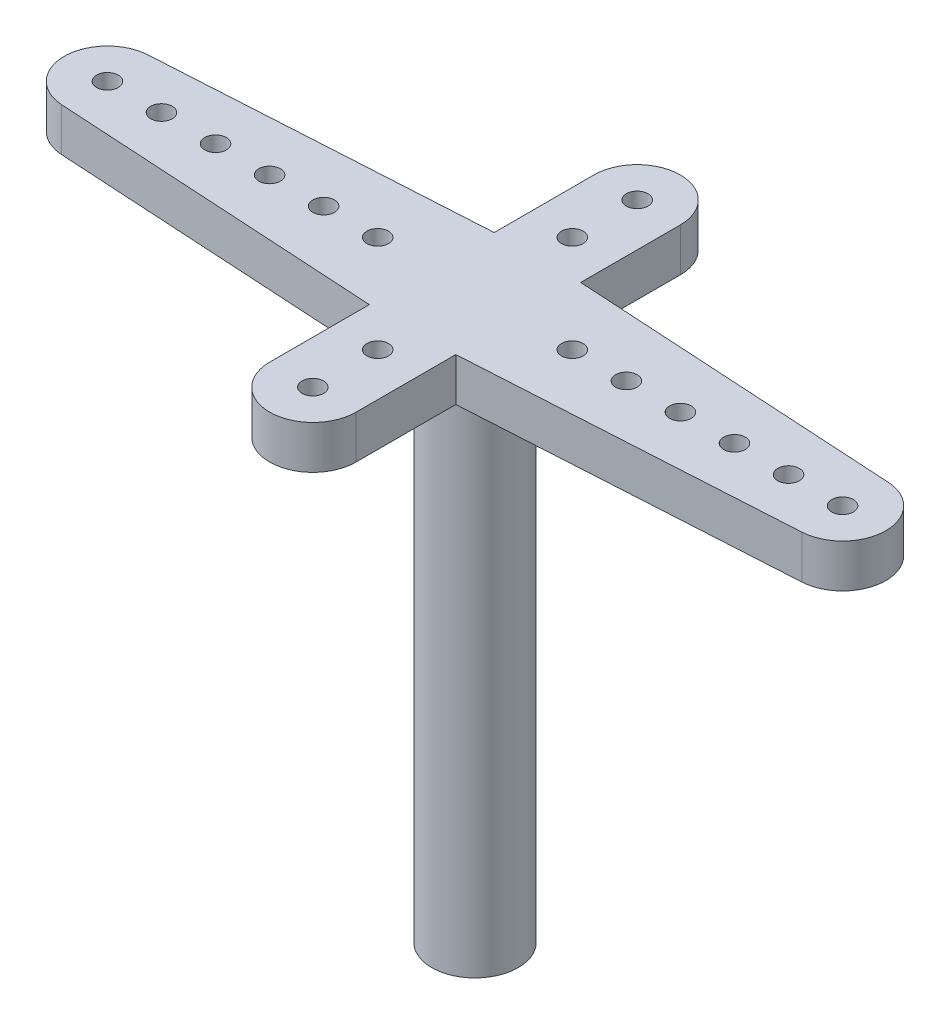
ISO-10303-21;
HEADER;
FILE_DESCRIPTION(('STEP AP214'),'2;1');
FILE_NAME('part.step','',(''),(''),'','','');
FILE_SCHEMA(('AUTOMOTIVE_DESIGN { 1 0 10303 214 1 1 1 1 }'));
ENDSEC;
DATA;
#1=APPLICATION_CONTEXT('core data for automotive mechanical design processes');
#2=APPLICATION_PROTOCOL_DEFINITION('international standard','automotive_design',2000,#1);
#3=PRODUCT_CONTEXT('',#1,'mechanical');
#4=PRODUCT('Part','Part','',(#3));
#5=PRODUCT_RELATED_PRODUCT_CATEGORY('part','',(#4));
#6=PRODUCT_DEFINITION_FORMATION('','',#4);
#7=PRODUCT_DEFINITION_CONTEXT('part definition',#1,'design');
#8=PRODUCT_DEFINITION('design','',#6,#7);
#9=PRODUCT_DEFINITION_SHAPE('','',#8);
#10=(LENGTH_UNIT() NAMED_UNIT(*) SI_UNIT(.MILLI.,.METRE.));
#11=(NAMED_UNIT(*) PLANE_ANGLE_UNIT() SI_UNIT($,.RADIAN.));
#12=(NAMED_UNIT(*) SI_UNIT($,.STERADIAN.) SOLID_ANGLE_UNIT());
#13=UNCERTAINTY_MEASURE_WITH_UNIT(LENGTH_MEASURE(1.E-05),#10,'distance_accuracy_value','');
#14=(GEOMETRIC_REPRESENTATION_CONTEXT(3) GLOBAL_UNCERTAINTY_ASSIGNED_CONTEXT((#13)) GLOBAL_UNIT_ASSIGNED_CONTEXT((#10,
#11,#12)) REPRESENTATION_CONTEXT('',''));
#15=CARTESIAN_POINT('',(0.,0.,0.));
#16=DIRECTION('',(0.,0.,1.));
#17=DIRECTION('',(1.,0.,0.));
#18=AXIS2_PLACEMENT_3D('',#15,#16,#17);
#19=CARTESIAN_POINT('',(17.,2.,0.));
#20=DIRECTION('',(0.,-1.,0.));
#21=DIRECTION('',(0.,0.,-1.));
#22=AXIS2_PLACEMENT_3D('',#19,#20,#21);
#23=PLANE('',#22);
#24=CARTESIAN_POINT('',(17.,2.,0.));
#25=DIRECTION('',(0.,1.,0.));
#26=DIRECTION('',(0.,0.,-1.));
#27=AXIS2_PLACEMENT_3D('',#24,#25,#26);
#28=CIRCLE('',#27,2.);
#29=CARTESIAN_POINT('',(17.1176470588235,2.,1.99653679393849));
#30=VERTEX_POINT('',#29);
#31=CARTESIAN_POINT('',(17.1176470588235,2.,-1.99653679393849));
#32=VERTEX_POINT('',#31);
#33=EDGE_CURVE('E182',#30,#32,#28,.T.);
#34=ORIENTED_EDGE('',*,*,#33,.T.);
#35=DIRECTION('',(-0.998268396969243,0.,-0.0588235294117646));
#36=VECTOR('',#35,1.);
#37=CARTESIAN_POINT('',(17.1176470588235,2.,-1.99653679393849));
#38=LINE('',#37,#36);
#39=CARTESIAN_POINT('',(2.,2.,-2.88735268984507));
#40=VERTEX_POINT('',#39);
#41=EDGE_CURVE('E110',#32,#40,#38,.T.);
#42=ORIENTED_EDGE('',*,*,#41,.T.);
#43=DIRECTION('',(0.,0.,-1.));
#44=VECTOR('',#43,1.);
#45=CARTESIAN_POINT('',(2.,2.,-7.5));
#46=LINE('',#45,#44);
#47=CARTESIAN_POINT('',(2.,2.,-7.5));
#48=VERTEX_POINT('',#47);
#49=EDGE_CURVE('E209',#40,#48,#46,.T.);
#50=ORIENTED_EDGE('',*,*,#49,.T.);
#51=CARTESIAN_POINT('',(0.,2.,-7.5));
#52=DIRECTION('',(0.,1.,0.));
#53=DIRECTION('',(0.,0.,-1.));
#54=AXIS2_PLACEMENT_3D('',#51,#52,#53);
#55=CIRCLE('',#54,2.);
#56=CARTESIAN_POINT('',(-2.,2.,-7.5));
#57=VERTEX_POINT('',#56);
#58=EDGE_CURVE('E228',#48,#57,#55,.T.);
#59=ORIENTED_EDGE('',*,*,#58,.T.);
#60=DIRECTION('',(0.,0.,1.));
#61=VECTOR('',#60,1.);
#62=CARTESIAN_POINT('',(-2.,2.,-7.5));
#63=LINE('',#62,#61);
#64=CARTESIAN_POINT('',(-2.,2.,-2.88735268984507));
#65=VERTEX_POINT('',#64);
#66=EDGE_CURVE('E225',#57,#65,#63,.T.);
#67=ORIENTED_EDGE('',*,*,#66,.T.);
#68=DIRECTION('',(-0.998268396969243,0.,0.0588235294117646));
#69=VECTOR('',#68,1.);
#70=CARTESIAN_POINT('',(-17.1176470588235,2.,-1.99653679393849));
#71=LINE('',#70,#69);
#72=CARTESIAN_POINT('',(-17.1176470588235,2.,-1.99653679393849));
#73=VERTEX_POINT('',#72);
#74=EDGE_CURVE('E227',#65,#73,#71,.T.);
#75=ORIENTED_EDGE('',*,*,#74,.T.);
#76=CARTESIAN_POINT('',(-17.,2.,0.));
#77=DIRECTION('',(0.,1.,0.));
#78=DIRECTION('',(0.,0.,1.));
#79=AXIS2_PLACEMENT_3D('',#76,#77,#78);
#80=CIRCLE('',#79,2.);
#81=CARTESIAN_POINT('',(-17.1176470588235,2.,1.99653679393849));
#82=VERTEX_POINT('',#81);
#83=EDGE_CURVE('E230',#73,#82,#80,.T.);
#84=ORIENTED_EDGE('',*,*,#83,.T.);
#85=DIRECTION('',(0.998268396969243,0.,0.0588235294117647));
#86=VECTOR('',#85,1.);
#87=CARTESIAN_POINT('',(-17.1176470588235,2.,1.99653679393849));
#88=LINE('',#87,#86);
#89=CARTESIAN_POINT('',(-2.,2.,2.88735268984507));
#90=VERTEX_POINT('',#89);
#91=EDGE_CURVE('E236',#82,#90,#88,.T.);
#92=ORIENTED_EDGE('',*,*,#91,.T.);
#93=DIRECTION('',(0.,0.,1.));
#94=VECTOR('',#93,1.);
#95=CARTESIAN_POINT('',(-2.,2.,7.5));
#96=LINE('',#95,#94);
#97=CARTESIAN_POINT('',(-2.,2.,7.5));
#98=VERTEX_POINT('',#97);
#99=EDGE_CURVE('E141',#90,#98,#96,.T.);
#100=ORIENTED_EDGE('',*,*,#99,.T.);
#101=CARTESIAN_POINT('',(0.,2.,7.5));
#102=DIRECTION('',(0.,1.,0.));
#103=DIRECTION('',(0.,0.,1.));
#104=AXIS2_PLACEMENT_3D('',#101,#102,#103);
#105=CIRCLE('',#104,2.);
#106=CARTESIAN_POINT('',(2.,2.,7.5));
#107=VERTEX_POINT('',#106);
#108=EDGE_CURVE('E135',#98,#107,#105,.T.);
#109=ORIENTED_EDGE('',*,*,#108,.T.);
#110=DIRECTION('',(0.,0.,-1.));
#111=VECTOR('',#110,1.);
#112=CARTESIAN_POINT('',(2.,2.,7.5));
#113=LINE('',#112,#111);
#114=CARTESIAN_POINT('',(2.,2.,2.88735268984507));
#115=VERTEX_POINT('',#114);
#116=EDGE_CURVE('E139',#107,#115,#113,.T.);
#117=ORIENTED_EDGE('',*,*,#116,.T.);
#118=DIRECTION('',(0.998268396969243,0.,-0.0588235294117647));
#119=VECTOR('',#118,1.);
#120=CARTESIAN_POINT('',(17.1176470588235,2.,1.99653679393849));
#121=LINE('',#120,#119);
#122=EDGE_CURVE('E55',#115,#30,#121,.T.);
#123=ORIENTED_EDGE('',*,*,#122,.T.);
#124=EDGE_LOOP('',(#34,#42,#50,#59,#67,#75,#84,#92,#100,#109,#117,#123));
#125=FACE_BOUND('',#124,.T.);
#126=CARTESIAN_POINT('',(-17.,2.,0.));
#127=DIRECTION('',(0.,1.,0.));
#128=DIRECTION('',(0.,0.,1.));
#129=AXIS2_PLACEMENT_3D('',#126,#127,#128);
#130=CIRCLE('',#129,0.499999999999999);
#131=CARTESIAN_POINT('',(-17.,2.,0.499999999999999));
#132=VERTEX_POINT('',#131);
#133=EDGE_CURVE('E163',#132,#132,#130,.T.);
#134=ORIENTED_EDGE('',*,*,#133,.F.);
#135=EDGE_LOOP('',(#134));
#136=FACE_BOUND('',#135,.T.);
#137=CARTESIAN_POINT('',(17.,2.,0.));
#138=DIRECTION('',(0.,1.,0.));
#139=DIRECTION('',(0.,0.,-1.));
#140=AXIS2_PLACEMENT_3D('',#137,#138,#139);
#141=CIRCLE('',#140,0.499999999999999);
#142=CARTESIAN_POINT('',(17.,2.,-0.499999999999999));
#143=VERTEX_POINT('',#142);
#144=EDGE_CURVE('E432',#143,#143,#141,.T.);
#145=ORIENTED_EDGE('',*,*,#144,.F.);
#146=EDGE_LOOP('',(#145));
#147=FACE_BOUND('',#146,.T.);
#148=CARTESIAN_POINT('',(-14.5,2.,0.));
#149=DIRECTION('',(0.,1.,0.));
#150=DIRECTION('',(0.,0.,1.));
#151=AXIS2_PLACEMENT_3D('',#148,#149,#150);
#152=CIRCLE('',#151,0.499999999999999);
#153=CARTESIAN_POINT('',(-14.5,2.,0.499999999999999));
#154=VERTEX_POINT('',#153);
#155=EDGE_CURVE('E426',#154,#154,#152,.T.);
#156=ORIENTED_EDGE('',*,*,#155,.F.);
#157=EDGE_LOOP('',(#156));
#158=FACE_BOUND('',#157,.T.);
#159=CARTESIAN_POINT('',(-12.,2.,0.));
#160=DIRECTION('',(0.,1.,0.));
#161=DIRECTION('',(0.,0.,1.));
#162=AXIS2_PLACEMENT_3D('',#159,#160,#161);
#163=CIRCLE('',#162,0.499999999999999);
#164=CARTESIAN_POINT('',(-12.,2.,0.499999999999999));
#165=VERTEX_POINT('',#164);
#166=EDGE_CURVE('E420',#165,#165,#163,.T.);
#167=ORIENTED_EDGE('',*,*,#166,.F.);
#168=EDGE_LOOP('',(#167));
#169=FACE_BOUND('',#168,.T.);
#170=CARTESIAN_POINT('',(-9.5,2.,0.));
#171=DIRECTION('',(0.,1.,0.));
#172=DIRECTION('',(0.,0.,1.));
#173=AXIS2_PLACEMENT_3D('',#170,#171,#172);
#174=CIRCLE('',#173,0.499999999999999);
#175=CARTESIAN_POINT('',(-9.5,2.,0.499999999999999));
#176=VERTEX_POINT('',#175);
#177=EDGE_CURVE('E414',#176,#176,#174,.T.);
#178=ORIENTED_EDGE('',*,*,#177,.F.);
#179=EDGE_LOOP('',(#178));
#180=FACE_BOUND('',#179,.T.);
#181=CARTESIAN_POINT('',(-7.,2.,0.));
#182=DIRECTION('',(0.,1.,0.));
#183=DIRECTION('',(0.,0.,1.));
#184=AXIS2_PLACEMENT_3D('',#181,#182,#183);
#185=CIRCLE('',#184,0.499999999999999);
#186=CARTESIAN_POINT('',(-7.,2.,0.499999999999999));
#187=VERTEX_POINT('',#186);
#188=EDGE_CURVE('E408',#187,#187,#185,.T.);
#189=ORIENTED_EDGE('',*,*,#188,.F.);
#190=EDGE_LOOP('',(#189));
#191=FACE_BOUND('',#190,.T.);
#192=CARTESIAN_POINT('',(-4.5,2.,0.));
#193=DIRECTION('',(0.,1.,0.));
#194=DIRECTION('',(0.,0.,1.));
#195=AXIS2_PLACEMENT_3D('',#192,#193,#194);
#196=CIRCLE('',#195,0.499999999999999);
#197=CARTESIAN_POINT('',(-4.5,2.,0.499999999999999));
#198=VERTEX_POINT('',#197);
#199=EDGE_CURVE('E402',#198,#198,#196,.T.);
#200=ORIENTED_EDGE('',*,*,#199,.F.);
#201=EDGE_LOOP('',(#200));
#202=FACE_BOUND('',#201,.T.);
#203=CARTESIAN_POINT('',(4.5,2.,0.));
#204=DIRECTION('',(0.,1.,0.));
#205=DIRECTION('',(0.,0.,-1.));
#206=AXIS2_PLACEMENT_3D('',#203,#204,#205);
#207=CIRCLE('',#206,0.499999999999999);
#208=CARTESIAN_POINT('',(4.5,2.,-0.499999999999999));
#209=VERTEX_POINT('',#208);
#210=EDGE_CURVE('E396',#209,#209,#207,.T.);
#211=ORIENTED_EDGE('',*,*,#210,.F.);
#212=EDGE_LOOP('',(#211));
#213=FACE_BOUND('',#212,.T.);
#214=CARTESIAN_POINT('',(7.,2.,0.));
#215=DIRECTION('',(0.,1.,0.));
#216=DIRECTION('',(0.,0.,-1.));
#217=AXIS2_PLACEMENT_3D('',#214,#215,#216);
#218=CIRCLE('',#217,0.499999999999999);
#219=CARTESIAN_POINT('',(7.,2.,-0.499999999999999));
#220=VERTEX_POINT('',#219);
#221=EDGE_CURVE('E390',#220,#220,#218,.T.);
#222=ORIENTED_EDGE('',*,*,#221,.F.);
#223=EDGE_LOOP('',(#222));
#224=FACE_BOUND('',#223,.T.);
#225=CARTESIAN_POINT('',(9.5,2.,0.));
#226=DIRECTION('',(0.,1.,0.));
#227=DIRECTION('',(0.,0.,-1.));
#228=AXIS2_PLACEMENT_3D('',#225,#226,#227);
#229=CIRCLE('',#228,0.499999999999999);
#230=CARTESIAN_POINT('',(9.5,2.,-0.499999999999999));
#231=VERTEX_POINT('',#230);
#232=EDGE_CURVE('E384',#231,#231,#229,.T.);
#233=ORIENTED_EDGE('',*,*,#232,.F.);
#234=EDGE_LOOP('',(#233));
#235=FACE_BOUND('',#234,.T.);
#236=CARTESIAN_POINT('',(12.,2.,0.));
#237=DIRECTION('',(0.,1.,0.));
#238=DIRECTION('',(0.,0.,-1.));
#239=AXIS2_PLACEMENT_3D('',#236,#237,#238);
#240=CIRCLE('',#239,0.499999999999999);
#241=CARTESIAN_POINT('',(12.,2.,-0.499999999999999));
#242=VERTEX_POINT('',#241);
#243=EDGE_CURVE('E378',#242,#242,#240,.T.);
#244=ORIENTED_EDGE('',*,*,#243,.F.);
#245=EDGE_LOOP('',(#244));
#246=FACE_BOUND('',#245,.T.);
#247=CARTESIAN_POINT('',(14.5,2.,0.));
#248=DIRECTION('',(0.,1.,0.));
#249=DIRECTION('',(0.,0.,-1.));
#250=AXIS2_PLACEMENT_3D('',#247,#248,#249);
#251=CIRCLE('',#250,0.499999999999999);
#252=CARTESIAN_POINT('',(14.5,2.,-0.499999999999999));
#253=VERTEX_POINT('',#252);
#254=EDGE_CURVE('E372',#253,#253,#251,.T.);
#255=ORIENTED_EDGE('',*,*,#254,.F.);
#256=EDGE_LOOP('',(#255));
#257=FACE_BOUND('',#256,.T.);
#258=CARTESIAN_POINT('',(0.,2.,-7.5));
#259=DIRECTION('',(0.,1.,0.));
#260=DIRECTION('',(0.,0.,1.));
#261=AXIS2_PLACEMENT_3D('',#258,#259,#260);
#262=CIRCLE('',#261,0.5);
#263=CARTESIAN_POINT('',(0.,2.,-7.));
#264=VERTEX_POINT('',#263);
#265=EDGE_CURVE('E366',#264,#264,#262,.T.);
#266=ORIENTED_EDGE('',*,*,#265,.F.);
#267=EDGE_LOOP('',(#266));
#268=FACE_BOUND('',#267,.T.);
#269=CARTESIAN_POINT('',(0.,2.,-4.5));
#270=DIRECTION('',(0.,1.,0.));
#271=DIRECTION('',(0.,0.,1.));
#272=AXIS2_PLACEMENT_3D('',#269,#270,#271);
#273=CIRCLE('',#272,0.5);
#274=CARTESIAN_POINT('',(0.,2.,-4.));
#275=VERTEX_POINT('',#274);
#276=EDGE_CURVE('E360',#275,#275,#273,.T.);
#277=ORIENTED_EDGE('',*,*,#276,.F.);
#278=EDGE_LOOP('',(#277));
#279=FACE_BOUND('',#278,.T.);
#280=CARTESIAN_POINT('',(0.,2.,4.5));
#281=DIRECTION('',(0.,1.,0.));
#282=DIRECTION('',(0.,0.,-1.));
#283=AXIS2_PLACEMENT_3D('',#280,#281,#282);
#284=CIRCLE('',#283,0.5);
#285=CARTESIAN_POINT('',(0.,2.,4.));
#286=VERTEX_POINT('',#285);
#287=EDGE_CURVE('E354',#286,#286,#284,.T.);
#288=ORIENTED_EDGE('',*,*,#287,.F.);
#289=EDGE_LOOP('',(#288));
#290=FACE_BOUND('',#289,.T.);
#291=CARTESIAN_POINT('',(0.,2.,7.5));
#292=DIRECTION('',(0.,1.,0.));
#293=DIRECTION('',(0.,0.,-1.));
#294=AXIS2_PLACEMENT_3D('',#291,#292,#293);
#295=CIRCLE('',#294,0.5);
#296=CARTESIAN_POINT('',(0.,2.,7.));
#297=VERTEX_POINT('',#296);
#298=EDGE_CURVE('E348',#297,#297,#295,.T.);
#299=ORIENTED_EDGE('',*,*,#298,.F.);
#300=EDGE_LOOP('',(#299));
#301=FACE_BOUND('',#300,.T.);
#302=ADVANCED_FACE('F38',(#125,#136,#147,#158,#169,#180,#191,#202,#213,#224,#235,#246,#257,#268,
#279,#290,#301),#23,.F.);
#303=CARTESIAN_POINT('',(17.,0.,0.));
#304=DIRECTION('',(0.,-1.,0.));
#305=DIRECTION('',(0.,0.,-1.));
#306=AXIS2_PLACEMENT_3D('',#303,#304,#305);
#307=PLANE('',#306);
#308=CARTESIAN_POINT('',(0.,0.,4.5));
#309=DIRECTION('',(0.,1.,0.));
#310=DIRECTION('',(0.,0.,-1.));
#311=AXIS2_PLACEMENT_3D('',#308,#309,#310);
#312=CIRCLE('',#311,0.5);
#313=CARTESIAN_POINT('',(0.,0.,4.));
#314=VERTEX_POINT('',#313);
#315=EDGE_CURVE('E351',#314,#314,#312,.T.);
#316=ORIENTED_EDGE('',*,*,#315,.T.);
#317=EDGE_LOOP('',(#316));
#318=FACE_BOUND('',#317,.T.);
#319=CARTESIAN_POINT('',(0.,0.,-7.5));
#320=DIRECTION('',(0.,1.,0.));
#321=DIRECTION('',(0.,0.,1.));
#322=AXIS2_PLACEMENT_3D('',#319,#320,#321);
#323=CIRCLE('',#322,0.5);
#324=CARTESIAN_POINT('',(0.,0.,-7.));
#325=VERTEX_POINT('',#324);
#326=EDGE_CURVE('E363',#325,#325,#323,.T.);
#327=ORIENTED_EDGE('',*,*,#326,.T.);
#328=EDGE_LOOP('',(#327));
#329=FACE_BOUND('',#328,.T.);
#330=CARTESIAN_POINT('',(12.,0.,0.));
#331=DIRECTION('',(0.,1.,0.));
#332=DIRECTION('',(0.,0.,-1.));
#333=AXIS2_PLACEMENT_3D('',#330,#331,#332);
#334=CIRCLE('',#333,0.499999999999999);
#335=CARTESIAN_POINT('',(12.,0.,-0.499999999999999));
#336=VERTEX_POINT('',#335);
#337=EDGE_CURVE('E375',#336,#336,#334,.T.);
#338=ORIENTED_EDGE('',*,*,#337,.T.);
#339=EDGE_LOOP('',(#338));
#340=FACE_BOUND('',#339,.T.);
#341=CARTESIAN_POINT('',(7.,0.,0.));
#342=DIRECTION('',(0.,1.,0.));
#343=DIRECTION('',(0.,0.,-1.));
#344=AXIS2_PLACEMENT_3D('',#341,#342,#343);
#345=CIRCLE('',#344,0.499999999999999);
#346=CARTESIAN_POINT('',(7.,0.,-0.499999999999999));
#347=VERTEX_POINT('',#346);
#348=EDGE_CURVE('E387',#347,#347,#345,.T.);
#349=ORIENTED_EDGE('',*,*,#348,.T.);
#350=EDGE_LOOP('',(#349));
#351=FACE_BOUND('',#350,.T.);
#352=CARTESIAN_POINT('',(-4.5,0.,0.));
#353=DIRECTION('',(0.,1.,0.));
#354=DIRECTION('',(0.,0.,1.));
#355=AXIS2_PLACEMENT_3D('',#352,#353,#354);
#356=CIRCLE('',#355,0.499999999999999);
#357=CARTESIAN_POINT('',(-4.5,0.,0.499999999999999));
#358=VERTEX_POINT('',#357);
#359=EDGE_CURVE('E399',#358,#358,#356,.T.);
#360=ORIENTED_EDGE('',*,*,#359,.T.);
#361=EDGE_LOOP('',(#360));
#362=FACE_BOUND('',#361,.T.);
#363=CARTESIAN_POINT('',(-9.5,0.,0.));
#364=DIRECTION('',(0.,1.,0.));
#365=DIRECTION('',(0.,0.,1.));
#366=AXIS2_PLACEMENT_3D('',#363,#364,#365);
#367=CIRCLE('',#366,0.499999999999999);
#368=CARTESIAN_POINT('',(-9.5,0.,0.499999999999999));
#369=VERTEX_POINT('',#368);
#370=EDGE_CURVE('E411',#369,#369,#367,.T.);
#371=ORIENTED_EDGE('',*,*,#370,.T.);
#372=EDGE_LOOP('',(#371));
#373=FACE_BOUND('',#372,.T.);
#374=CARTESIAN_POINT('',(-14.5,0.,0.));
#375=DIRECTION('',(0.,1.,0.));
#376=DIRECTION('',(0.,0.,1.));
#377=AXIS2_PLACEMENT_3D('',#374,#375,#376);
#378=CIRCLE('',#377,0.499999999999999);
#379=CARTESIAN_POINT('',(-14.5,0.,0.499999999999999));
#380=VERTEX_POINT('',#379);
#381=EDGE_CURVE('E423',#380,#380,#378,.T.);
#382=ORIENTED_EDGE('',*,*,#381,.T.);
#383=EDGE_LOOP('',(#382));
#384=FACE_BOUND('',#383,.T.);
#385=CARTESIAN_POINT('',(-17.,0.,0.));
#386=DIRECTION('',(0.,1.,0.));
#387=DIRECTION('',(0.,0.,1.));
#388=AXIS2_PLACEMENT_3D('',#385,#386,#387);
#389=CIRCLE('',#388,0.499999999999999);
#390=CARTESIAN_POINT('',(-17.,0.,0.499999999999999));
#391=VERTEX_POINT('',#390);
#392=EDGE_CURVE('E435',#391,#391,#389,.T.);
#393=ORIENTED_EDGE('',*,*,#392,.T.);
#394=EDGE_LOOP('',(#393));
#395=FACE_BOUND('',#394,.T.);
#396=CARTESIAN_POINT('',(17.,0.,0.));
#397=DIRECTION('',(0.,1.,0.));
#398=DIRECTION('',(0.,0.,-1.));
#399=AXIS2_PLACEMENT_3D('',#396,#397,#398);
#400=CIRCLE('',#399,2.);
#401=CARTESIAN_POINT('',(17.1176470588235,0.,1.99653679393849));
#402=VERTEX_POINT('',#401);
#403=CARTESIAN_POINT('',(17.1176470588235,0.,-1.99653679393849));
#404=VERTEX_POINT('',#403);
#405=EDGE_CURVE('E159',#402,#404,#400,.T.);
#406=ORIENTED_EDGE('',*,*,#405,.F.);
#407=DIRECTION('',(0.998268396969243,0.,-0.0588235294117647));
#408=VECTOR('',#407,1.);
#409=CARTESIAN_POINT('',(17.1176470588235,0.,1.99653679393849));
#410=LINE('',#409,#408);
#411=CARTESIAN_POINT('',(2.,0.,2.88735268984507));
#412=VERTEX_POINT('',#411);
#413=EDGE_CURVE('E102',#412,#402,#410,.T.);
#414=ORIENTED_EDGE('',*,*,#413,.F.);
#415=DIRECTION('',(0.,0.,-1.));
#416=VECTOR('',#415,1.);
#417=CARTESIAN_POINT('',(2.,0.,7.5));
#418=LINE('',#417,#416);
#419=CARTESIAN_POINT('',(2.,0.,7.5));
#420=VERTEX_POINT('',#419);
#421=EDGE_CURVE('E96',#420,#412,#418,.T.);
#422=ORIENTED_EDGE('',*,*,#421,.F.);
#423=CARTESIAN_POINT('',(0.,0.,7.5));
#424=DIRECTION('',(0.,1.,0.));
#425=DIRECTION('',(0.,0.,1.));
#426=AXIS2_PLACEMENT_3D('',#423,#424,#425);
#427=CIRCLE('',#426,2.);
#428=CARTESIAN_POINT('',(-2.,0.,7.5));
#429=VERTEX_POINT('',#428);
#430=EDGE_CURVE('E149',#429,#420,#427,.T.);
#431=ORIENTED_EDGE('',*,*,#430,.F.);
#432=DIRECTION('',(0.,0.,1.));
#433=VECTOR('',#432,1.);
#434=CARTESIAN_POINT('',(-2.,0.,7.5));
#435=LINE('',#434,#433);
#436=CARTESIAN_POINT('',(-2.,0.,2.88735268984507));
#437=VERTEX_POINT('',#436);
#438=EDGE_CURVE('E177',#437,#429,#435,.T.);
#439=ORIENTED_EDGE('',*,*,#438,.F.);
#440=DIRECTION('',(0.998268396969243,0.,0.0588235294117647));
#441=VECTOR('',#440,1.);
#442=CARTESIAN_POINT('',(-17.1176470588235,0.,1.99653679393849));
#443=LINE('',#442,#441);
#444=CARTESIAN_POINT('',(-17.1176470588235,0.,1.99653679393849));
#445=VERTEX_POINT('',#444);
#446=EDGE_CURVE('E175',#445,#437,#443,.T.);
#447=ORIENTED_EDGE('',*,*,#446,.F.);
#448=CARTESIAN_POINT('',(-17.,0.,0.));
#449=DIRECTION('',(0.,1.,0.));
#450=DIRECTION('',(0.,0.,1.));
#451=AXIS2_PLACEMENT_3D('',#448,#449,#450);
#452=CIRCLE('',#451,2.);
#453=CARTESIAN_POINT('',(-17.1176470588235,0.,-1.99653679393849));
#454=VERTEX_POINT('',#453);
#455=EDGE_CURVE('E173',#454,#445,#452,.T.);
#456=ORIENTED_EDGE('',*,*,#455,.F.);
#457=DIRECTION('',(-0.998268396969243,0.,0.0588235294117646));
#458=VECTOR('',#457,1.);
#459=CARTESIAN_POINT('',(-17.1176470588235,0.,-1.99653679393849));
#460=LINE('',#459,#458);
#461=CARTESIAN_POINT('',(-2.,0.,-2.88735268984507));
#462=VERTEX_POINT('',#461);
#463=EDGE_CURVE('E171',#462,#454,#460,.T.);
#464=ORIENTED_EDGE('',*,*,#463,.F.);
#465=DIRECTION('',(0.,0.,1.));
#466=VECTOR('',#465,1.);
#467=CARTESIAN_POINT('',(-2.,0.,-7.5));
#468=LINE('',#467,#466);
#469=CARTESIAN_POINT('',(-2.,0.,-7.5));
#470=VERTEX_POINT('',#469);
#471=EDGE_CURVE('E169',#470,#462,#468,.T.);
#472=ORIENTED_EDGE('',*,*,#471,.F.);
#473=CARTESIAN_POINT('',(0.,0.,-7.5));
#474=DIRECTION('',(0.,1.,0.));
#475=DIRECTION('',(0.,0.,-1.));
#476=AXIS2_PLACEMENT_3D('',#473,#474,#475);
#477=CIRCLE('',#476,2.);
#478=CARTESIAN_POINT('',(2.,0.,-7.5));
#479=VERTEX_POINT('',#478);
#480=EDGE_CURVE('E167',#479,#470,#477,.T.);
#481=ORIENTED_EDGE('',*,*,#480,.F.);
#482=DIRECTION('',(0.,0.,-1.));
#483=VECTOR('',#482,1.);
#484=CARTESIAN_POINT('',(2.,0.,-7.5));
#485=LINE('',#484,#483);
#486=CARTESIAN_POINT('',(2.,0.,-2.88735268984507));
#487=VERTEX_POINT('',#486);
#488=EDGE_CURVE('E165',#487,#479,#485,.T.);
#489=ORIENTED_EDGE('',*,*,#488,.F.);
#490=DIRECTION('',(-0.998268396969243,0.,-0.0588235294117646));
#491=VECTOR('',#490,1.);
#492=CARTESIAN_POINT('',(17.1176470588235,0.,-1.99653679393849));
#493=LINE('',#492,#491);
#494=EDGE_CURVE('E162',#404,#487,#493,.T.);
#495=ORIENTED_EDGE('',*,*,#494,.F.);
#496=EDGE_LOOP('',(#406,#414,#422,#431,#439,#447,#456,#464,#472,#481,#489,#495));
#497=FACE_BOUND('',#496,.T.);
#498=CARTESIAN_POINT('',(0.,0.,0.));
#499=DIRECTION('',(0.,-1.,0.));
#500=DIRECTION('',(0.,0.,-1.));
#501=AXIS2_PLACEMENT_3D('',#498,#499,#500);
#502=CIRCLE('',#501,2.);
#503=CARTESIAN_POINT('',(0.,0.,-2.));
#504=VERTEX_POINT('',#503);
#505=EDGE_CURVE('E342',#504,#504,#502,.F.);
#506=ORIENTED_EDGE('',*,*,#505,.T.);
#507=EDGE_LOOP('',(#506));
#508=FACE_BOUND('',#507,.T.);
#509=CARTESIAN_POINT('',(17.,0.,0.));
#510=DIRECTION('',(0.,1.,0.));
#511=DIRECTION('',(0.,0.,-1.));
#512=AXIS2_PLACEMENT_3D('',#509,#510,#511);
#513=CIRCLE('',#512,0.499999999999999);
#514=CARTESIAN_POINT('',(17.,0.,-0.499999999999999));
#515=VERTEX_POINT('',#514);
#516=EDGE_CURVE('E429',#515,#515,#513,.T.);
#517=ORIENTED_EDGE('',*,*,#516,.T.);
#518=EDGE_LOOP('',(#517));
#519=FACE_BOUND('',#518,.T.);
#520=CARTESIAN_POINT('',(-12.,0.,0.));
#521=DIRECTION('',(0.,1.,0.));
#522=DIRECTION('',(0.,0.,1.));
#523=AXIS2_PLACEMENT_3D('',#520,#521,#522);
#524=CIRCLE('',#523,0.499999999999999);
#525=CARTESIAN_POINT('',(-12.,0.,0.499999999999999));
#526=VERTEX_POINT('',#525);
#527=EDGE_CURVE('E417',#526,#526,#524,.T.);
#528=ORIENTED_EDGE('',*,*,#527,.T.);
#529=EDGE_LOOP('',(#528));
#530=FACE_BOUND('',#529,.T.);
#531=CARTESIAN_POINT('',(-7.,0.,0.));
#532=DIRECTION('',(0.,1.,0.));
#533=DIRECTION('',(0.,0.,1.));
#534=AXIS2_PLACEMENT_3D('',#531,#532,#533);
#535=CIRCLE('',#534,0.499999999999999);
#536=CARTESIAN_POINT('',(-7.,0.,0.499999999999999));
#537=VERTEX_POINT('',#536);
#538=EDGE_CURVE('E405',#537,#537,#535,.T.);
#539=ORIENTED_EDGE('',*,*,#538,.T.);
#540=EDGE_LOOP('',(#539));
#541=FACE_BOUND('',#540,.T.);
#542=CARTESIAN_POINT('',(4.5,0.,0.));
#543=DIRECTION('',(0.,1.,0.));
#544=DIRECTION('',(0.,0.,-1.));
#545=AXIS2_PLACEMENT_3D('',#542,#543,#544);
#546=CIRCLE('',#545,0.499999999999999);
#547=CARTESIAN_POINT('',(4.5,0.,-0.499999999999999));
#548=VERTEX_POINT('',#547);
#549=EDGE_CURVE('E393',#548,#548,#546,.T.);
#550=ORIENTED_EDGE('',*,*,#549,.T.);
#551=EDGE_LOOP('',(#550));
#552=FACE_BOUND('',#551,.T.);
#553=CARTESIAN_POINT('',(9.5,0.,0.));
#554=DIRECTION('',(0.,1.,0.));
#555=DIRECTION('',(0.,0.,-1.));
#556=AXIS2_PLACEMENT_3D('',#553,#554,#555);
#557=CIRCLE('',#556,0.499999999999999);
#558=CARTESIAN_POINT('',(9.5,0.,-0.499999999999999));
#559=VERTEX_POINT('',#558);
#560=EDGE_CURVE('E381',#559,#559,#557,.T.);
#561=ORIENTED_EDGE('',*,*,#560,.T.);
#562=EDGE_LOOP('',(#561));
#563=FACE_BOUND('',#562,.T.);
#564=CARTESIAN_POINT('',(14.5,0.,0.));
#565=DIRECTION('',(0.,1.,0.));
#566=DIRECTION('',(0.,0.,-1.));
#567=AXIS2_PLACEMENT_3D('',#564,#565,#566);
#568=CIRCLE('',#567,0.499999999999999);
#569=CARTESIAN_POINT('',(14.5,0.,-0.499999999999999));
#570=VERTEX_POINT('',#569);
#571=EDGE_CURVE('E369',#570,#570,#568,.T.);
#572=ORIENTED_EDGE('',*,*,#571,.T.);
#573=EDGE_LOOP('',(#572));
#574=FACE_BOUND('',#573,.T.);
#575=CARTESIAN_POINT('',(0.,0.,-4.5));
#576=DIRECTION('',(0.,1.,0.));
#577=DIRECTION('',(0.,0.,1.));
#578=AXIS2_PLACEMENT_3D('',#575,#576,#577);
#579=CIRCLE('',#578,0.5);
#580=CARTESIAN_POINT('',(0.,0.,-4.));
#581=VERTEX_POINT('',#580);
#582=EDGE_CURVE('E357',#581,#581,#579,.T.);
#583=ORIENTED_EDGE('',*,*,#582,.T.);
#584=EDGE_LOOP('',(#583));
#585=FACE_BOUND('',#584,.T.);
#586=CARTESIAN_POINT('',(0.,0.,7.5));
#587=DIRECTION('',(0.,1.,0.));
#588=DIRECTION('',(0.,0.,-1.));
#589=AXIS2_PLACEMENT_3D('',#586,#587,#588);
#590=CIRCLE('',#589,0.5);
#591=CARTESIAN_POINT('',(0.,0.,7.));
#592=VERTEX_POINT('',#591);
#593=EDGE_CURVE('E345',#592,#592,#590,.T.);
#594=ORIENTED_EDGE('',*,*,#593,.T.);
#595=EDGE_LOOP('',(#594));
#596=FACE_BOUND('',#595,.T.);
#597=ADVANCED_FACE('F213',(#318,#329,#340,#351,#362,#373,#384,#395,#497,#508,#519,#530,#541,
#552,#563,#574,#585,#596),#307,.T.);
#598=CARTESIAN_POINT('',(17.,2.,0.));
#599=DIRECTION('',(0.,-1.,0.));
#600=DIRECTION('',(0.,0.,-1.));
#601=AXIS2_PLACEMENT_3D('',#598,#599,#600);
#602=CYLINDRICAL_SURFACE('',#601,2.);
#603=ORIENTED_EDGE('',*,*,#405,.T.);
#604=DIRECTION('',(0.,-1.,0.));
#605=VECTOR('',#604,1.);
#606=CARTESIAN_POINT('',(17.1176470588235,2.,-1.99653679393849));
#607=LINE('',#606,#605);
#608=EDGE_CURVE('E11',#32,#404,#607,.T.);
#609=ORIENTED_EDGE('',*,*,#608,.F.);
#610=ORIENTED_EDGE('',*,*,#33,.F.);
#611=DIRECTION('',(0.,-1.,0.));
#612=VECTOR('',#611,1.);
#613=CARTESIAN_POINT('',(17.1176470588235,2.,1.99653679393849));
#614=LINE('',#613,#612);
#615=EDGE_CURVE('E155',#30,#402,#614,.T.);
#616=ORIENTED_EDGE('',*,*,#615,.T.);
#617=EDGE_LOOP('',(#603,#609,#610,#616));
#618=FACE_BOUND('',#617,.T.);
#619=ADVANCED_FACE('F40',(#618),#602,.T.);
#620=CARTESIAN_POINT('',(17.1176470588235,2.,-1.99653679393849));
#621=DIRECTION('',(-0.0588235294117647,0.,0.998268396969244));
#622=DIRECTION('',(0.998268396969244,0.,0.0588235294117647));
#623=AXIS2_PLACEMENT_3D('',#620,#621,#622);
#624=PLANE('',#623);
#625=ORIENTED_EDGE('',*,*,#494,.T.);
#626=DIRECTION('',(0.,-1.,0.));
#627=VECTOR('',#626,1.);
#628=CARTESIAN_POINT('',(2.,2.,-2.88735268984507));
#629=LINE('',#628,#627);
#630=EDGE_CURVE('E47',#40,#487,#629,.T.);
#631=ORIENTED_EDGE('',*,*,#630,.F.);
#632=ORIENTED_EDGE('',*,*,#41,.F.);
#633=ORIENTED_EDGE('',*,*,#608,.T.);
#634=EDGE_LOOP('',(#625,#631,#632,#633));
#635=FACE_BOUND('',#634,.T.);
#636=ADVANCED_FACE('F669',(#635),#624,.F.);
#637=CARTESIAN_POINT('',(2.,2.,-7.5));
#638=DIRECTION('',(-1.,0.,0.));
#639=DIRECTION('',(0.,0.,1.));
#640=AXIS2_PLACEMENT_3D('',#637,#638,#639);
#641=PLANE('',#640);
#642=ORIENTED_EDGE('',*,*,#488,.T.);
#643=DIRECTION('',(0.,-1.,0.));
#644=VECTOR('',#643,1.);
#645=CARTESIAN_POINT('',(2.,2.,-7.5));
#646=LINE('',#645,#644);
#647=EDGE_CURVE('E201',#48,#479,#646,.T.);
#648=ORIENTED_EDGE('',*,*,#647,.F.);
#649=ORIENTED_EDGE('',*,*,#49,.F.);
#650=ORIENTED_EDGE('',*,*,#630,.T.);
#651=EDGE_LOOP('',(#642,#648,#649,#650));
#652=FACE_BOUND('',#651,.T.);
#653=ADVANCED_FACE('F207',(#652),#641,.F.);
#654=CARTESIAN_POINT('',(0.,2.,-7.5));
#655=DIRECTION('',(0.,-1.,0.));
#656=DIRECTION('',(0.,0.,-1.));
#657=AXIS2_PLACEMENT_3D('',#654,#655,#656);
#658=CYLINDRICAL_SURFACE('',#657,2.);
#659=ORIENTED_EDGE('',*,*,#480,.T.);
#660=DIRECTION('',(0.,-1.,0.));
#661=VECTOR('',#660,1.);
#662=CARTESIAN_POINT('',(-2.,2.,-7.5));
#663=LINE('',#662,#661);
#664=EDGE_CURVE('E198',#57,#470,#663,.T.);
#665=ORIENTED_EDGE('',*,*,#664,.F.);
#666=ORIENTED_EDGE('',*,*,#58,.F.);
#667=ORIENTED_EDGE('',*,*,#647,.T.);
#668=EDGE_LOOP('',(#659,#665,#666,#667));
#669=FACE_BOUND('',#668,.T.);
#670=ADVANCED_FACE('F219',(#669),#658,.T.);
#671=CARTESIAN_POINT('',(-2.,2.,-7.5));
#672=DIRECTION('',(1.,0.,0.));
#673=DIRECTION('',(0.,0.,-1.));
#674=AXIS2_PLACEMENT_3D('',#671,#672,#673);
#675=PLANE('',#674);
#676=ORIENTED_EDGE('',*,*,#471,.T.);
#677=DIRECTION('',(0.,-1.,0.));
#678=VECTOR('',#677,1.);
#679=CARTESIAN_POINT('',(-2.,2.,-2.88735268984507));
#680=LINE('',#679,#678);
#681=EDGE_CURVE('E195',#65,#462,#680,.T.);
#682=ORIENTED_EDGE('',*,*,#681,.F.);
#683=ORIENTED_EDGE('',*,*,#66,.F.);
#684=ORIENTED_EDGE('',*,*,#664,.T.);
#685=EDGE_LOOP('',(#676,#682,#683,#684));
#686=FACE_BOUND('',#685,.T.);
#687=ADVANCED_FACE('F223',(#686),#675,.F.);
#688=CARTESIAN_POINT('',(-17.1176470588235,2.,-1.99653679393849));
#689=DIRECTION('',(0.0588235294117647,0.,0.998268396969244));
#690=DIRECTION('',(0.998268396969244,0.,-0.0588235294117647));
#691=AXIS2_PLACEMENT_3D('',#688,#689,#690);
#692=PLANE('',#691);
#693=ORIENTED_EDGE('',*,*,#463,.T.);
#694=DIRECTION('',(0.,-1.,0.));
#695=VECTOR('',#694,1.);
#696=CARTESIAN_POINT('',(-17.1176470588235,2.,-1.99653679393849));
#697=LINE('',#696,#695);
#698=EDGE_CURVE('E192',#73,#454,#697,.T.);
#699=ORIENTED_EDGE('',*,*,#698,.F.);
#700=ORIENTED_EDGE('',*,*,#74,.F.);
#701=ORIENTED_EDGE('',*,*,#681,.T.);
#702=EDGE_LOOP('',(#693,#699,#700,#701));
#703=FACE_BOUND('',#702,.T.);
#704=ADVANCED_FACE('F634',(#703),#692,.F.);
#705=CARTESIAN_POINT('',(-17.,2.,0.));
#706=DIRECTION('',(0.,-1.,0.));
#707=DIRECTION('',(0.,0.,-1.));
#708=AXIS2_PLACEMENT_3D('',#705,#706,#707);
#709=CYLINDRICAL_SURFACE('',#708,2.);
#710=ORIENTED_EDGE('',*,*,#455,.T.);
#711=DIRECTION('',(0.,-1.,0.));
#712=VECTOR('',#711,1.);
#713=CARTESIAN_POINT('',(-17.1176470588235,2.,1.99653679393849));
#714=LINE('',#713,#712);
#715=EDGE_CURVE('E189',#82,#445,#714,.T.);
#716=ORIENTED_EDGE('',*,*,#715,.F.);
#717=ORIENTED_EDGE('',*,*,#83,.F.);
#718=ORIENTED_EDGE('',*,*,#698,.T.);
#719=EDGE_LOOP('',(#710,#716,#717,#718));
#720=FACE_BOUND('',#719,.T.);
#721=ADVANCED_FACE('F625',(#720),#709,.T.);
#722=CARTESIAN_POINT('',(-17.1176470588235,2.,1.99653679393849));
#723=DIRECTION('',(0.0588235294117647,0.,-0.998268396969244));
#724=DIRECTION('',(-0.998268396969244,0.,-0.0588235294117647));
#725=AXIS2_PLACEMENT_3D('',#722,#723,#724);
#726=PLANE('',#725);
#727=ORIENTED_EDGE('',*,*,#446,.T.);
#728=DIRECTION('',(0.,-1.,0.));
#729=VECTOR('',#728,1.);
#730=CARTESIAN_POINT('',(-2.,2.,2.88735268984507));
#731=LINE('',#730,#729);
#732=EDGE_CURVE('E186',#90,#437,#731,.T.);
#733=ORIENTED_EDGE('',*,*,#732,.F.);
#734=ORIENTED_EDGE('',*,*,#91,.F.);
#735=ORIENTED_EDGE('',*,*,#715,.T.);
#736=EDGE_LOOP('',(#727,#733,#734,#735));
#737=FACE_BOUND('',#736,.T.);
#738=ADVANCED_FACE('F242',(#737),#726,.F.);
#739=CARTESIAN_POINT('',(-2.,2.,7.5));
#740=DIRECTION('',(1.,0.,0.));
#741=DIRECTION('',(0.,0.,-1.));
#742=AXIS2_PLACEMENT_3D('',#739,#740,#741);
#743=PLANE('',#742);
#744=ORIENTED_EDGE('',*,*,#438,.T.);
#745=DIRECTION('',(0.,-1.,0.));
#746=VECTOR('',#745,1.);
#747=CARTESIAN_POINT('',(-2.,2.,7.5));
#748=LINE('',#747,#746);
#749=EDGE_CURVE('E150',#98,#429,#748,.T.);
#750=ORIENTED_EDGE('',*,*,#749,.F.);
#751=ORIENTED_EDGE('',*,*,#99,.F.);
#752=ORIENTED_EDGE('',*,*,#732,.T.);
#753=EDGE_LOOP('',(#744,#750,#751,#752));
#754=FACE_BOUND('',#753,.T.);
#755=ADVANCED_FACE('F246',(#754),#743,.F.);
#756=CARTESIAN_POINT('',(0.,2.,7.5));
#757=DIRECTION('',(0.,-1.,0.));
#758=DIRECTION('',(0.,0.,-1.));
#759=AXIS2_PLACEMENT_3D('',#756,#757,#758);
#760=CYLINDRICAL_SURFACE('',#759,2.);
#761=ORIENTED_EDGE('',*,*,#430,.T.);
#762=DIRECTION('',(0.,-1.,0.));
#763=VECTOR('',#762,1.);
#764=CARTESIAN_POINT('',(2.,2.,7.5));
#765=LINE('',#764,#763);
#766=EDGE_CURVE('E146',#107,#420,#765,.T.);
#767=ORIENTED_EDGE('',*,*,#766,.F.);
#768=ORIENTED_EDGE('',*,*,#108,.F.);
#769=ORIENTED_EDGE('',*,*,#749,.T.);
#770=EDGE_LOOP('',(#761,#767,#768,#769));
#771=FACE_BOUND('',#770,.T.);
#772=ADVANCED_FACE('F147',(#771),#760,.T.);
#773=CARTESIAN_POINT('',(2.,2.,7.5));
#774=DIRECTION('',(-1.,0.,0.));
#775=DIRECTION('',(0.,0.,1.));
#776=AXIS2_PLACEMENT_3D('',#773,#774,#775);
#777=PLANE('',#776);
#778=ORIENTED_EDGE('',*,*,#421,.T.);
#779=DIRECTION('',(0.,-1.,0.));
#780=VECTOR('',#779,1.);
#781=CARTESIAN_POINT('',(2.,2.,2.88735268984507));
#782=LINE('',#781,#780);
#783=EDGE_CURVE('E151',#115,#412,#782,.T.);
#784=ORIENTED_EDGE('',*,*,#783,.F.);
#785=ORIENTED_EDGE('',*,*,#116,.F.);
#786=ORIENTED_EDGE('',*,*,#766,.T.);
#787=EDGE_LOOP('',(#778,#784,#785,#786));
#788=FACE_BOUND('',#787,.T.);
#789=ADVANCED_FACE('F153',(#788),#777,.F.);
#790=CARTESIAN_POINT('',(17.1176470588235,2.,1.99653679393849));
#791=DIRECTION('',(-0.0588235294117647,0.,-0.998268396969244));
#792=DIRECTION('',(-0.998268396969244,0.,0.0588235294117647));
#793=AXIS2_PLACEMENT_3D('',#790,#791,#792);
#794=PLANE('',#793);
#795=ORIENTED_EDGE('',*,*,#413,.T.);
#796=ORIENTED_EDGE('',*,*,#615,.F.);
#797=ORIENTED_EDGE('',*,*,#122,.F.);
#798=ORIENTED_EDGE('',*,*,#783,.T.);
#799=EDGE_LOOP('',(#795,#796,#797,#798));
#800=FACE_BOUND('',#799,.T.);
#801=ADVANCED_FACE('F250',(#800),#794,.F.);
#802=CARTESIAN_POINT('',(-17.,2.,0.));
#803=DIRECTION('',(0.,-1.,0.));
#804=DIRECTION('',(0.,0.,-1.));
#805=AXIS2_PLACEMENT_3D('',#802,#803,#804);
#806=CYLINDRICAL_SURFACE('',#805,0.499999999999999);
#807=ORIENTED_EDGE('',*,*,#133,.T.);
#808=EDGE_LOOP('',(#807));
#809=FACE_BOUND('',#808,.T.);
#810=ORIENTED_EDGE('',*,*,#392,.F.);
#811=EDGE_LOOP('',(#810));
#812=FACE_BOUND('',#811,.T.);
#813=ADVANCED_FACE('F252',(#809,#812),#806,.F.);
#814=CARTESIAN_POINT('',(17.,2.,0.));
#815=DIRECTION('',(0.,-1.,0.));
#816=DIRECTION('',(0.,0.,-1.));
#817=AXIS2_PLACEMENT_3D('',#814,#815,#816);
#818=CYLINDRICAL_SURFACE('',#817,0.499999999999999);
#819=ORIENTED_EDGE('',*,*,#144,.T.);
#820=EDGE_LOOP('',(#819));
#821=FACE_BOUND('',#820,.T.);
#822=ORIENTED_EDGE('',*,*,#516,.F.);
#823=EDGE_LOOP('',(#822));
#824=FACE_BOUND('',#823,.T.);
#825=ADVANCED_FACE('F258',(#821,#824),#818,.F.);
#826=CARTESIAN_POINT('',(-14.5,2.,0.));
#827=DIRECTION('',(0.,-1.,0.));
#828=DIRECTION('',(0.,0.,-1.));
#829=AXIS2_PLACEMENT_3D('',#826,#827,#828);
#830=CYLINDRICAL_SURFACE('',#829,0.499999999999999);
#831=ORIENTED_EDGE('',*,*,#155,.T.);
#832=EDGE_LOOP('',(#831));
#833=FACE_BOUND('',#832,.T.);
#834=ORIENTED_EDGE('',*,*,#381,.F.);
#835=EDGE_LOOP('',(#834));
#836=FACE_BOUND('',#835,.T.);
#837=ADVANCED_FACE('F272',(#833,#836),#830,.F.);
#838=CARTESIAN_POINT('',(-12.,2.,0.));
#839=DIRECTION('',(0.,-1.,0.));
#840=DIRECTION('',(0.,0.,-1.));
#841=AXIS2_PLACEMENT_3D('',#838,#839,#840);
#842=CYLINDRICAL_SURFACE('',#841,0.499999999999999);
#843=ORIENTED_EDGE('',*,*,#166,.T.);
#844=EDGE_LOOP('',(#843));
#845=FACE_BOUND('',#844,.T.);
#846=ORIENTED_EDGE('',*,*,#527,.F.);
#847=EDGE_LOOP('',(#846));
#848=FACE_BOUND('',#847,.T.);
#849=ADVANCED_FACE('F276',(#845,#848),#842,.F.);
#850=CARTESIAN_POINT('',(-9.5,2.,0.));
#851=DIRECTION('',(0.,-1.,0.));
#852=DIRECTION('',(0.,0.,-1.));
#853=AXIS2_PLACEMENT_3D('',#850,#851,#852);
#854=CYLINDRICAL_SURFACE('',#853,0.499999999999999);
#855=ORIENTED_EDGE('',*,*,#177,.T.);
#856=EDGE_LOOP('',(#855));
#857=FACE_BOUND('',#856,.T.);
#858=ORIENTED_EDGE('',*,*,#370,.F.);
#859=EDGE_LOOP('',(#858));
#860=FACE_BOUND('',#859,.T.);
#861=ADVANCED_FACE('F280',(#857,#860),#854,.F.);
#862=CARTESIAN_POINT('',(-7.,2.,0.));
#863=DIRECTION('',(0.,-1.,0.));
#864=DIRECTION('',(0.,0.,-1.));
#865=AXIS2_PLACEMENT_3D('',#862,#863,#864);
#866=CYLINDRICAL_SURFACE('',#865,0.499999999999999);
#867=ORIENTED_EDGE('',*,*,#188,.T.);
#868=EDGE_LOOP('',(#867));
#869=FACE_BOUND('',#868,.T.);
#870=ORIENTED_EDGE('',*,*,#538,.F.);
#871=EDGE_LOOP('',(#870));
#872=FACE_BOUND('',#871,.T.);
#873=ADVANCED_FACE('F284',(#869,#872),#866,.F.);
#874=CARTESIAN_POINT('',(-4.5,2.,0.));
#875=DIRECTION('',(0.,-1.,0.));
#876=DIRECTION('',(0.,0.,-1.));
#877=AXIS2_PLACEMENT_3D('',#874,#875,#876);
#878=CYLINDRICAL_SURFACE('',#877,0.499999999999999);
#879=ORIENTED_EDGE('',*,*,#199,.T.);
#880=EDGE_LOOP('',(#879));
#881=FACE_BOUND('',#880,.T.);
#882=ORIENTED_EDGE('',*,*,#359,.F.);
#883=EDGE_LOOP('',(#882));
#884=FACE_BOUND('',#883,.T.);
#885=ADVANCED_FACE('F288',(#881,#884),#878,.F.);
#886=CARTESIAN_POINT('',(4.5,2.,0.));
#887=DIRECTION('',(0.,-1.,0.));
#888=DIRECTION('',(0.,0.,-1.));
#889=AXIS2_PLACEMENT_3D('',#886,#887,#888);
#890=CYLINDRICAL_SURFACE('',#889,0.499999999999999);
#891=ORIENTED_EDGE('',*,*,#210,.T.);
#892=EDGE_LOOP('',(#891));
#893=FACE_BOUND('',#892,.T.);
#894=ORIENTED_EDGE('',*,*,#549,.F.);
#895=EDGE_LOOP('',(#894));
#896=FACE_BOUND('',#895,.T.);
#897=ADVANCED_FACE('F292',(#893,#896),#890,.F.);
#898=CARTESIAN_POINT('',(7.,2.,0.));
#899=DIRECTION('',(0.,-1.,0.));
#900=DIRECTION('',(0.,0.,-1.));
#901=AXIS2_PLACEMENT_3D('',#898,#899,#900);
#902=CYLINDRICAL_SURFACE('',#901,0.499999999999999);
#903=ORIENTED_EDGE('',*,*,#221,.T.);
#904=EDGE_LOOP('',(#903));
#905=FACE_BOUND('',#904,.T.);
#906=ORIENTED_EDGE('',*,*,#348,.F.);
#907=EDGE_LOOP('',(#906));
#908=FACE_BOUND('',#907,.T.);
#909=ADVANCED_FACE('F296',(#905,#908),#902,.F.);
#910=CARTESIAN_POINT('',(9.5,2.,0.));
#911=DIRECTION('',(0.,-1.,0.));
#912=DIRECTION('',(0.,0.,-1.));
#913=AXIS2_PLACEMENT_3D('',#910,#911,#912);
#914=CYLINDRICAL_SURFACE('',#913,0.499999999999999);
#915=ORIENTED_EDGE('',*,*,#232,.T.);
#916=EDGE_LOOP('',(#915));
#917=FACE_BOUND('',#916,.T.);
#918=ORIENTED_EDGE('',*,*,#560,.F.);
#919=EDGE_LOOP('',(#918));
#920=FACE_BOUND('',#919,.T.);
#921=ADVANCED_FACE('F300',(#917,#920),#914,.F.);
#922=CARTESIAN_POINT('',(12.,2.,0.));
#923=DIRECTION('',(0.,-1.,0.));
#924=DIRECTION('',(0.,0.,-1.));
#925=AXIS2_PLACEMENT_3D('',#922,#923,#924);
#926=CYLINDRICAL_SURFACE('',#925,0.499999999999999);
#927=ORIENTED_EDGE('',*,*,#243,.T.);
#928=EDGE_LOOP('',(#927));
#929=FACE_BOUND('',#928,.T.);
#930=ORIENTED_EDGE('',*,*,#337,.F.);
#931=EDGE_LOOP('',(#930));
#932=FACE_BOUND('',#931,.T.);
#933=ADVANCED_FACE('F304',(#929,#932),#926,.F.);
#934=CARTESIAN_POINT('',(14.5,2.,0.));
#935=DIRECTION('',(0.,-1.,0.));
#936=DIRECTION('',(0.,0.,-1.));
#937=AXIS2_PLACEMENT_3D('',#934,#935,#936);
#938=CYLINDRICAL_SURFACE('',#937,0.499999999999999);
#939=ORIENTED_EDGE('',*,*,#254,.T.);
#940=EDGE_LOOP('',(#939));
#941=FACE_BOUND('',#940,.T.);
#942=ORIENTED_EDGE('',*,*,#571,.F.);
#943=EDGE_LOOP('',(#942));
#944=FACE_BOUND('',#943,.T.);
#945=ADVANCED_FACE('F308',(#941,#944),#938,.F.);
#946=CARTESIAN_POINT('',(0.,2.,-7.5));
#947=DIRECTION('',(0.,-1.,0.));
#948=DIRECTION('',(0.,0.,-1.));
#949=AXIS2_PLACEMENT_3D('',#946,#947,#948);
#950=CYLINDRICAL_SURFACE('',#949,0.5);
#951=ORIENTED_EDGE('',*,*,#265,.T.);
#952=EDGE_LOOP('',(#951));
#953=FACE_BOUND('',#952,.T.);
#954=ORIENTED_EDGE('',*,*,#326,.F.);
#955=EDGE_LOOP('',(#954));
#956=FACE_BOUND('',#955,.T.);
#957=ADVANCED_FACE('F312',(#953,#956),#950,.F.);
#958=CARTESIAN_POINT('',(0.,2.,-4.5));
#959=DIRECTION('',(0.,-1.,0.));
#960=DIRECTION('',(0.,0.,-1.));
#961=AXIS2_PLACEMENT_3D('',#958,#959,#960);
#962=CYLINDRICAL_SURFACE('',#961,0.5);
#963=ORIENTED_EDGE('',*,*,#276,.T.);
#964=EDGE_LOOP('',(#963));
#965=FACE_BOUND('',#964,.T.);
#966=ORIENTED_EDGE('',*,*,#582,.F.);
#967=EDGE_LOOP('',(#966));
#968=FACE_BOUND('',#967,.T.);
#969=ADVANCED_FACE('F316',(#965,#968),#962,.F.);
#970=CARTESIAN_POINT('',(0.,2.,4.5));
#971=DIRECTION('',(0.,-1.,0.));
#972=DIRECTION('',(0.,0.,-1.));
#973=AXIS2_PLACEMENT_3D('',#970,#971,#972);
#974=CYLINDRICAL_SURFACE('',#973,0.5);
#975=ORIENTED_EDGE('',*,*,#287,.T.);
#976=EDGE_LOOP('',(#975));
#977=FACE_BOUND('',#976,.T.);
#978=ORIENTED_EDGE('',*,*,#315,.F.);
#979=EDGE_LOOP('',(#978));
#980=FACE_BOUND('',#979,.T.);
#981=ADVANCED_FACE('F320',(#977,#980),#974,.F.);
#982=CARTESIAN_POINT('',(0.,2.,7.5));
#983=DIRECTION('',(0.,-1.,0.));
#984=DIRECTION('',(0.,0.,-1.));
#985=AXIS2_PLACEMENT_3D('',#982,#983,#984);
#986=CYLINDRICAL_SURFACE('',#985,0.5);
#987=ORIENTED_EDGE('',*,*,#298,.T.);
#988=EDGE_LOOP('',(#987));
#989=FACE_BOUND('',#988,.T.);
#990=ORIENTED_EDGE('',*,*,#593,.F.);
#991=EDGE_LOOP('',(#990));
#992=FACE_BOUND('',#991,.T.);
#993=ADVANCED_FACE('F324',(#989,#992),#986,.F.);
#994=CARTESIAN_POINT('',(0.,-24.,0.));
#995=DIRECTION('',(0.,1.,0.));
#996=DIRECTION('',(0.,0.,1.));
#997=AXIS2_PLACEMENT_3D('',#994,#995,#996);
#998=CYLINDRICAL_SURFACE('',#997,2.);
#999=ORIENTED_EDGE('',*,*,#505,.F.);
#1000=EDGE_LOOP('',(#999));
#1001=FACE_BOUND('',#1000,.T.);
#1002=CARTESIAN_POINT('',(0.,-24.,0.));
#1003=DIRECTION('',(0.,-1.,0.));
#1004=DIRECTION('',(0.,0.,-1.));
#1005=AXIS2_PLACEMENT_3D('',#1002,#1003,#1004);
#1006=CIRCLE('',#1005,2.);
#1007=CARTESIAN_POINT('',(0.,-24.,-2.));
#1008=VERTEX_POINT('',#1007);
#1009=EDGE_CURVE('E340',#1008,#1008,#1006,.T.);
#1010=ORIENTED_EDGE('',*,*,#1009,.F.);
#1011=EDGE_LOOP('',(#1010));
#1012=FACE_BOUND('',#1011,.T.);
#1013=ADVANCED_FACE('F328',(#1001,#1012),#998,.T.);
#1014=CARTESIAN_POINT('',(0.,-24.,0.));
#1015=DIRECTION('',(0.,-1.,0.));
#1016=DIRECTION('',(0.,0.,-1.));
#1017=AXIS2_PLACEMENT_3D('',#1014,#1015,#1016);
#1018=PLANE('',#1017);
#1019=ORIENTED_EDGE('',*,*,#1009,.T.);
#1020=EDGE_LOOP('',(#1019));
#1021=FACE_BOUND('',#1020,.T.);
#1022=ADVANCED_FACE('F332',(#1021),#1018,.T.);
#1023=CLOSED_SHELL('',(#302,#597,#619,#636,#653,#670,#687,#704,#721,#738,#755,#772,#789,#801,
#813,#825,#837,#849,#861,#873,#885,#897,#909,#921,#933,#945,#957,#969,#981,#993,#1013,#1022));
#1024=MANIFOLD_SOLID_BREP('B2',#1023);
#1025=ADVANCED_BREP_SHAPE_REPRESENTATION('',(#18,#1024),#14);
#1026=SHAPE_DEFINITION_REPRESENTATION(#9,#1025);
ENDSEC;
END-ISO-10303-21;
